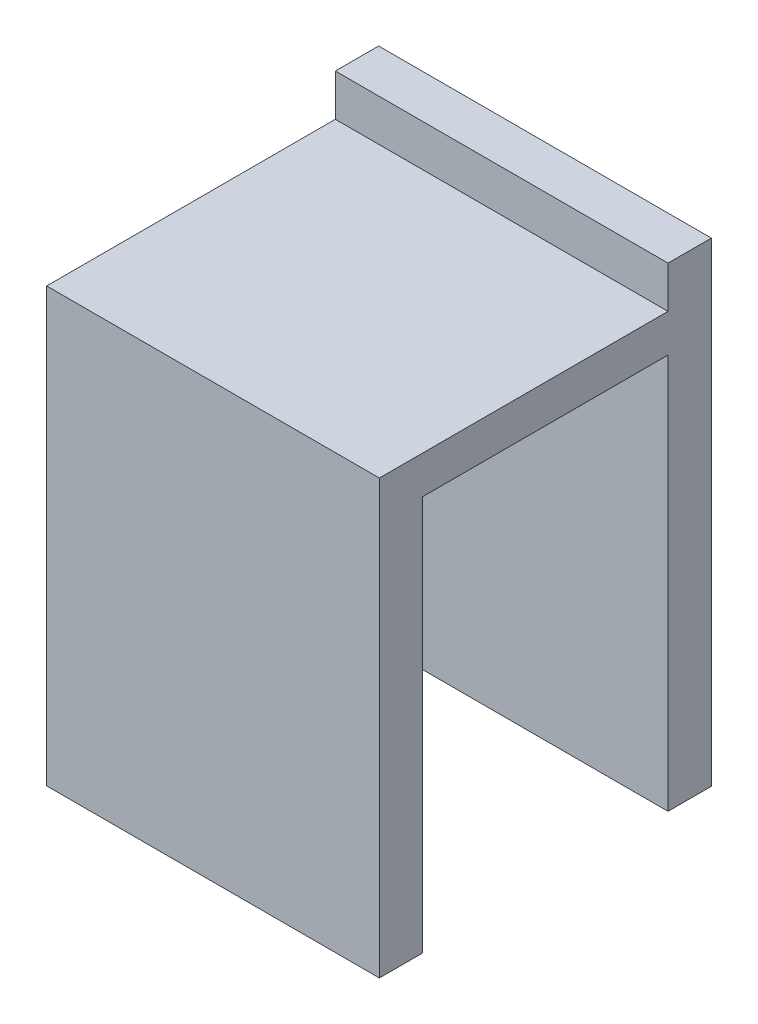
ISO-10303-21;
HEADER;
FILE_DESCRIPTION(('STEP AP214'),'2;1');
FILE_NAME('part.step','',(''),(''),'','','');
FILE_SCHEMA(('AUTOMOTIVE_DESIGN { 1 0 10303 214 1 1 1 1 }'));
ENDSEC;
DATA;
#1=APPLICATION_CONTEXT('core data for automotive mechanical design processes');
#2=APPLICATION_PROTOCOL_DEFINITION('international standard','automotive_design',2000,#1);
#3=PRODUCT_CONTEXT('',#1,'mechanical');
#4=PRODUCT('Part','Part','',(#3));
#5=PRODUCT_RELATED_PRODUCT_CATEGORY('part','',(#4));
#6=PRODUCT_DEFINITION_FORMATION('','',#4);
#7=PRODUCT_DEFINITION_CONTEXT('part definition',#1,'design');
#8=PRODUCT_DEFINITION('design','',#6,#7);
#9=PRODUCT_DEFINITION_SHAPE('','',#8);
#10=(LENGTH_UNIT() NAMED_UNIT(*) SI_UNIT(.MILLI.,.METRE.));
#11=(NAMED_UNIT(*) PLANE_ANGLE_UNIT() SI_UNIT($,.RADIAN.));
#12=(NAMED_UNIT(*) SI_UNIT($,.STERADIAN.) SOLID_ANGLE_UNIT());
#13=UNCERTAINTY_MEASURE_WITH_UNIT(LENGTH_MEASURE(1.E-05),#10,'distance_accuracy_value','');
#14=(GEOMETRIC_REPRESENTATION_CONTEXT(3) GLOBAL_UNCERTAINTY_ASSIGNED_CONTEXT((#13)) GLOBAL_UNIT_ASSIGNED_CONTEXT((#10,
#11,#12)) REPRESENTATION_CONTEXT('',''));
#15=CARTESIAN_POINT('',(0.,0.,0.));
#16=DIRECTION('',(0.,0.,1.));
#17=DIRECTION('',(1.,0.,0.));
#18=AXIS2_PLACEMENT_3D('',#15,#16,#17);
#19=CARTESIAN_POINT('',(-91.2408376963351,19.5358541731836,-180.));
#20=DIRECTION('',(0.,1.,0.));
#21=DIRECTION('',(0.,0.,1.));
#22=AXIS2_PLACEMENT_3D('',#19,#20,#21);
#23=PLANE('',#22);
#24=DIRECTION('',(-1.,0.,0.));
#25=VECTOR('',#24,1.);
#26=CARTESIAN_POINT('',(-91.2408376963351,19.5358541731836,-183.));
#27=LINE('',#26,#25);
#28=CARTESIAN_POINT('',(-68.1887783386787,19.5358541731836,-183.));
#29=VERTEX_POINT('',#28);
#30=CARTESIAN_POINT('',(-91.2408376963351,19.5358541731836,-183.));
#31=VERTEX_POINT('',#30);
#32=EDGE_CURVE('E119',#29,#31,#27,.T.);
#33=ORIENTED_EDGE('',*,*,#32,.T.);
#34=DIRECTION('',(0.,0.,-1.));
#35=VECTOR('',#34,1.);
#36=CARTESIAN_POINT('',(-91.2408376963351,19.5358541731836,-180.));
#37=LINE('',#36,#35);
#38=CARTESIAN_POINT('',(-91.2408376963351,19.5358541731836,-200.));
#39=VERTEX_POINT('',#38);
#40=EDGE_CURVE('E132',#31,#39,#37,.T.);
#41=ORIENTED_EDGE('',*,*,#40,.T.);
#42=DIRECTION('',(1.,0.,0.));
#43=VECTOR('',#42,1.);
#44=CARTESIAN_POINT('',(-91.2408376963351,19.5358541731836,-200.));
#45=LINE('',#44,#43);
#46=CARTESIAN_POINT('',(-68.1887783386787,19.5358541731836,-200.));
#47=VERTEX_POINT('',#46);
#48=EDGE_CURVE('E138',#39,#47,#45,.T.);
#49=ORIENTED_EDGE('',*,*,#48,.T.);
#50=DIRECTION('',(0.,0.,-1.));
#51=VECTOR('',#50,1.);
#52=CARTESIAN_POINT('',(-68.1887783386787,19.5358541731836,-180.));
#53=LINE('',#52,#51);
#54=EDGE_CURVE('E155',#29,#47,#53,.T.);
#55=ORIENTED_EDGE('',*,*,#54,.F.);
#56=EDGE_LOOP('',(#33,#41,#49,#55));
#57=FACE_BOUND('',#56,.T.);
#58=ADVANCED_FACE('F32',(#57),#23,.F.);
#59=CARTESIAN_POINT('',(0.,0.,-200.));
#60=DIRECTION('',(0.,0.,1.));
#61=DIRECTION('',(1.,0.,0.));
#62=AXIS2_PLACEMENT_3D('',#59,#60,#61);
#63=PLANE('',#62);
#64=DIRECTION('',(-1.,0.,0.));
#65=VECTOR('',#64,1.);
#66=CARTESIAN_POINT('',(-91.2408376963351,22.1544502617801,-200.));
#67=LINE('',#66,#65);
#68=CARTESIAN_POINT('',(-68.1887783386787,22.1544502617801,-200.));
#69=VERTEX_POINT('',#68);
#70=CARTESIAN_POINT('',(-91.2408376963351,22.1544502617801,-200.));
#71=VERTEX_POINT('',#70);
#72=EDGE_CURVE('E47',#69,#71,#67,.T.);
#73=ORIENTED_EDGE('',*,*,#72,.F.);
#74=DIRECTION('',(0.,-1.,0.));
#75=VECTOR('',#74,1.);
#76=CARTESIAN_POINT('',(-68.1887783386787,22.1544502617801,-200.));
#77=LINE('',#76,#75);
#78=CARTESIAN_POINT('',(-68.1887783386787,25.0516302200133,-200.));
#79=VERTEX_POINT('',#78);
#80=EDGE_CURVE('E174',#79,#69,#77,.T.);
#81=ORIENTED_EDGE('',*,*,#80,.F.);
#82=DIRECTION('',(1.,0.,0.));
#83=VECTOR('',#82,1.);
#84=CARTESIAN_POINT('',(-68.1887783386787,25.0516302200133,-200.));
#85=LINE('',#84,#83);
#86=CARTESIAN_POINT('',(-91.2408376963351,25.0516302200133,-200.));
#87=VERTEX_POINT('',#86);
#88=EDGE_CURVE('E158',#87,#79,#85,.T.);
#89=ORIENTED_EDGE('',*,*,#88,.F.);
#90=DIRECTION('',(0.,1.,0.));
#91=VECTOR('',#90,1.);
#92=CARTESIAN_POINT('',(-91.2408376963351,22.1544502617801,-200.));
#93=LINE('',#92,#91);
#94=EDGE_CURVE('E52',#71,#87,#93,.T.);
#95=ORIENTED_EDGE('',*,*,#94,.F.);
#96=EDGE_LOOP('',(#73,#81,#89,#95));
#97=FACE_BOUND('',#96,.T.);
#98=ADVANCED_FACE('F192',(#97),#63,.T.);
#99=CARTESIAN_POINT('',(-68.1887783386787,25.0516302200133,-203.));
#100=DIRECTION('',(0.,-1.,0.));
#101=DIRECTION('',(0.,0.,-1.));
#102=AXIS2_PLACEMENT_3D('',#99,#100,#101);
#103=PLANE('',#102);
#104=ORIENTED_EDGE('',*,*,#88,.T.);
#105=DIRECTION('',(0.,0.,1.));
#106=VECTOR('',#105,1.);
#107=CARTESIAN_POINT('',(-68.1887783386787,25.0516302200133,-203.));
#108=LINE('',#107,#106);
#109=CARTESIAN_POINT('',(-68.1887783386787,25.0516302200133,-203.));
#110=VERTEX_POINT('',#109);
#111=EDGE_CURVE('E40',#110,#79,#108,.T.);
#112=ORIENTED_EDGE('',*,*,#111,.F.);
#113=DIRECTION('',(1.,0.,0.));
#114=VECTOR('',#113,1.);
#115=CARTESIAN_POINT('',(-68.1887783386787,25.0516302200133,-203.));
#116=LINE('',#115,#114);
#117=CARTESIAN_POINT('',(-91.2408376963351,25.0516302200133,-203.));
#118=VERTEX_POINT('',#117);
#119=EDGE_CURVE('E162',#118,#110,#116,.T.);
#120=ORIENTED_EDGE('',*,*,#119,.F.);
#121=DIRECTION('',(0.,0.,1.));
#122=VECTOR('',#121,1.);
#123=CARTESIAN_POINT('',(-91.2408376963351,25.0516302200133,-203.));
#124=LINE('',#123,#122);
#125=EDGE_CURVE('E11',#118,#87,#124,.T.);
#126=ORIENTED_EDGE('',*,*,#125,.T.);
#127=EDGE_LOOP('',(#104,#112,#120,#126));
#128=FACE_BOUND('',#127,.T.);
#129=ADVANCED_FACE('F34',(#128),#103,.F.);
#130=CARTESIAN_POINT('',(-68.1887783386787,22.1544502617801,-203.));
#131=DIRECTION('',(-1.,0.,0.));
#132=DIRECTION('',(0.,0.,1.));
#133=AXIS2_PLACEMENT_3D('',#130,#131,#132);
#134=PLANE('',#133);
#135=ORIENTED_EDGE('',*,*,#80,.T.);
#136=DIRECTION('',(0.,0.,-1.));
#137=VECTOR('',#136,1.);
#138=CARTESIAN_POINT('',(-68.1887783386787,22.1544502617801,-180.));
#139=LINE('',#138,#137);
#140=CARTESIAN_POINT('',(-68.1887783386787,22.1544502617801,-180.));
#141=VERTEX_POINT('',#140);
#142=EDGE_CURVE('E152',#141,#69,#139,.T.);
#143=ORIENTED_EDGE('',*,*,#142,.F.);
#144=DIRECTION('',(0.,1.,0.));
#145=VECTOR('',#144,1.);
#146=CARTESIAN_POINT('',(-68.1887783386787,19.5358541731836,-180.));
#147=LINE('',#146,#145);
#148=CARTESIAN_POINT('',(-68.1887783386787,-7.84554973821993,-180.));
#149=VERTEX_POINT('',#148);
#150=EDGE_CURVE('E142',#149,#141,#147,.T.);
#151=ORIENTED_EDGE('',*,*,#150,.F.);
#152=DIRECTION('',(0.,0.,1.));
#153=VECTOR('',#152,1.);
#154=CARTESIAN_POINT('',(-68.1887783386787,-7.84554973821993,-183.));
#155=LINE('',#154,#153);
#156=CARTESIAN_POINT('',(-68.1887783386787,-7.84554973821993,-183.));
#157=VERTEX_POINT('',#156);
#158=EDGE_CURVE('E118',#157,#149,#155,.T.);
#159=ORIENTED_EDGE('',*,*,#158,.F.);
#160=DIRECTION('',(0.,1.,0.));
#161=VECTOR('',#160,1.);
#162=CARTESIAN_POINT('',(-68.1887783386787,19.5358541731836,-183.));
#163=LINE('',#162,#161);
#164=EDGE_CURVE('E127',#157,#29,#163,.T.);
#165=ORIENTED_EDGE('',*,*,#164,.T.);
#166=ORIENTED_EDGE('',*,*,#54,.T.);
#167=CARTESIAN_POINT('',(-68.1887783386787,-7.84554973821993,-200.));
#168=VERTEX_POINT('',#167);
#169=EDGE_CURVE('E173',#47,#168,#77,.T.);
#170=ORIENTED_EDGE('',*,*,#169,.T.);
#171=DIRECTION('',(0.,0.,1.));
#172=VECTOR('',#171,1.);
#173=CARTESIAN_POINT('',(-68.1887783386787,-7.84554973821993,-203.));
#174=LINE('',#173,#172);
#175=CARTESIAN_POINT('',(-68.1887783386787,-7.84554973821993,-203.));
#176=VERTEX_POINT('',#175);
#177=EDGE_CURVE('E181',#176,#168,#174,.T.);
#178=ORIENTED_EDGE('',*,*,#177,.F.);
#179=DIRECTION('',(0.,-1.,0.));
#180=VECTOR('',#179,1.);
#181=CARTESIAN_POINT('',(-68.1887783386787,22.1544502617801,-203.));
#182=LINE('',#181,#180);
#183=EDGE_CURVE('E165',#110,#176,#182,.T.);
#184=ORIENTED_EDGE('',*,*,#183,.F.);
#185=ORIENTED_EDGE('',*,*,#111,.T.);
#186=EDGE_LOOP('',(#135,#143,#151,#159,#165,#166,#170,#178,#184,#185));
#187=FACE_BOUND('',#186,.T.);
#188=ADVANCED_FACE('F187',(#187),#134,.F.);
#189=CARTESIAN_POINT('',(-91.2408376963351,-7.84554973821992,-203.));
#190=DIRECTION('',(0.,1.,0.));
#191=DIRECTION('',(-1.,0.,0.));
#192=AXIS2_PLACEMENT_3D('',#189,#190,#191);
#193=PLANE('',#192);
#194=DIRECTION('',(-1.,0.,0.));
#195=VECTOR('',#194,1.);
#196=CARTESIAN_POINT('',(-91.2408376963351,-7.84554973821992,-200.));
#197=LINE('',#196,#195);
#198=CARTESIAN_POINT('',(-91.2408376963351,-7.84554973821992,-200.));
#199=VERTEX_POINT('',#198);
#200=EDGE_CURVE('E176',#168,#199,#197,.T.);
#201=ORIENTED_EDGE('',*,*,#200,.T.);
#202=DIRECTION('',(0.,0.,1.));
#203=VECTOR('',#202,1.);
#204=CARTESIAN_POINT('',(-91.2408376963351,-7.84554973821992,-203.));
#205=LINE('',#204,#203);
#206=CARTESIAN_POINT('',(-91.2408376963351,-7.84554973821992,-203.));
#207=VERTEX_POINT('',#206);
#208=EDGE_CURVE('E170',#207,#199,#205,.T.);
#209=ORIENTED_EDGE('',*,*,#208,.F.);
#210=DIRECTION('',(-1.,0.,0.));
#211=VECTOR('',#210,1.);
#212=CARTESIAN_POINT('',(-91.2408376963351,-7.84554973821992,-203.));
#213=LINE('',#212,#211);
#214=EDGE_CURVE('E167',#176,#207,#213,.T.);
#215=ORIENTED_EDGE('',*,*,#214,.F.);
#216=ORIENTED_EDGE('',*,*,#177,.T.);
#217=EDGE_LOOP('',(#201,#209,#215,#216));
#218=FACE_BOUND('',#217,.T.);
#219=ADVANCED_FACE('F224',(#218),#193,.F.);
#220=CARTESIAN_POINT('',(-91.2408376963351,22.1544502617801,-203.));
#221=DIRECTION('',(1.,0.,0.));
#222=DIRECTION('',(0.,0.,-1.));
#223=AXIS2_PLACEMENT_3D('',#220,#221,#222);
#224=PLANE('',#223);
#225=EDGE_CURVE('E163',#199,#39,#93,.T.);
#226=ORIENTED_EDGE('',*,*,#225,.T.);
#227=ORIENTED_EDGE('',*,*,#40,.F.);
#228=DIRECTION('',(0.,-1.,0.));
#229=VECTOR('',#228,1.);
#230=CARTESIAN_POINT('',(-91.2408376963351,19.5358541731836,-183.));
#231=LINE('',#230,#229);
#232=CARTESIAN_POINT('',(-91.2408376963351,-7.84554973821993,-183.));
#233=VERTEX_POINT('',#232);
#234=EDGE_CURVE('E125',#31,#233,#231,.T.);
#235=ORIENTED_EDGE('',*,*,#234,.T.);
#236=DIRECTION('',(0.,0.,1.));
#237=VECTOR('',#236,1.);
#238=CARTESIAN_POINT('',(-91.2408376963351,-7.84554973821993,-183.));
#239=LINE('',#238,#237);
#240=CARTESIAN_POINT('',(-91.2408376963351,-7.84554973821993,-180.));
#241=VERTEX_POINT('',#240);
#242=EDGE_CURVE('E108',#233,#241,#239,.T.);
#243=ORIENTED_EDGE('',*,*,#242,.T.);
#244=DIRECTION('',(0.,-1.,0.));
#245=VECTOR('',#244,1.);
#246=CARTESIAN_POINT('',(-91.2408376963351,19.5358541731836,-180.));
#247=LINE('',#246,#245);
#248=CARTESIAN_POINT('',(-91.2408376963351,22.1544502617801,-180.));
#249=VERTEX_POINT('',#248);
#250=EDGE_CURVE('E140',#249,#241,#247,.T.);
#251=ORIENTED_EDGE('',*,*,#250,.F.);
#252=DIRECTION('',(0.,0.,-1.));
#253=VECTOR('',#252,1.);
#254=CARTESIAN_POINT('',(-91.2408376963351,22.1544502617801,-180.));
#255=LINE('',#254,#253);
#256=EDGE_CURVE('E146',#249,#71,#255,.T.);
#257=ORIENTED_EDGE('',*,*,#256,.T.);
#258=ORIENTED_EDGE('',*,*,#94,.T.);
#259=ORIENTED_EDGE('',*,*,#125,.F.);
#260=DIRECTION('',(0.,1.,0.));
#261=VECTOR('',#260,1.);
#262=CARTESIAN_POINT('',(-91.2408376963351,22.1544502617801,-203.));
#263=LINE('',#262,#261);
#264=EDGE_CURVE('E159',#207,#118,#263,.T.);
#265=ORIENTED_EDGE('',*,*,#264,.F.);
#266=ORIENTED_EDGE('',*,*,#208,.T.);
#267=EDGE_LOOP('',(#226,#227,#235,#243,#251,#257,#258,#259,#265,#266));
#268=FACE_BOUND('',#267,.T.);
#269=ADVANCED_FACE('F131',(#268),#224,.F.);
#270=CARTESIAN_POINT('',(0.,0.,-203.));
#271=DIRECTION('',(0.,0.,1.));
#272=DIRECTION('',(1.,0.,0.));
#273=AXIS2_PLACEMENT_3D('',#270,#271,#272);
#274=PLANE('',#273);
#275=ORIENTED_EDGE('',*,*,#264,.T.);
#276=ORIENTED_EDGE('',*,*,#119,.T.);
#277=ORIENTED_EDGE('',*,*,#183,.T.);
#278=ORIENTED_EDGE('',*,*,#214,.T.);
#279=EDGE_LOOP('',(#275,#276,#277,#278));
#280=FACE_BOUND('',#279,.T.);
#281=ADVANCED_FACE('F206',(#280),#274,.F.);
#282=ORIENTED_EDGE('',*,*,#48,.F.);
#283=ORIENTED_EDGE('',*,*,#225,.F.);
#284=ORIENTED_EDGE('',*,*,#200,.F.);
#285=ORIENTED_EDGE('',*,*,#169,.F.);
#286=EDGE_LOOP('',(#282,#283,#284,#285));
#287=FACE_BOUND('',#286,.T.);
#288=ADVANCED_FACE('F195',(#287),#63,.T.);
#289=CARTESIAN_POINT('',(-91.2408376963351,22.1544502617801,-180.));
#290=DIRECTION('',(0.,-1.,0.));
#291=DIRECTION('',(0.,0.,-1.));
#292=AXIS2_PLACEMENT_3D('',#289,#290,#291);
#293=PLANE('',#292);
#294=ORIENTED_EDGE('',*,*,#72,.T.);
#295=ORIENTED_EDGE('',*,*,#256,.F.);
#296=DIRECTION('',(-1.,0.,0.));
#297=VECTOR('',#296,1.);
#298=CARTESIAN_POINT('',(-91.2408376963351,22.1544502617801,-180.));
#299=LINE('',#298,#297);
#300=EDGE_CURVE('E144',#141,#249,#299,.T.);
#301=ORIENTED_EDGE('',*,*,#300,.F.);
#302=ORIENTED_EDGE('',*,*,#142,.T.);
#303=EDGE_LOOP('',(#294,#295,#301,#302));
#304=FACE_BOUND('',#303,.T.);
#305=ADVANCED_FACE('F205',(#304),#293,.F.);
#306=CARTESIAN_POINT('',(0.,0.,-180.));
#307=DIRECTION('',(0.,0.,-1.));
#308=DIRECTION('',(-1.,0.,0.));
#309=AXIS2_PLACEMENT_3D('',#306,#307,#308);
#310=PLANE('',#309);
#311=ORIENTED_EDGE('',*,*,#250,.T.);
#312=DIRECTION('',(1.,0.,0.));
#313=VECTOR('',#312,1.);
#314=CARTESIAN_POINT('',(-91.2408376963351,-7.84554973821993,-180.));
#315=LINE('',#314,#313);
#316=EDGE_CURVE('E114',#241,#149,#315,.T.);
#317=ORIENTED_EDGE('',*,*,#316,.T.);
#318=ORIENTED_EDGE('',*,*,#150,.T.);
#319=ORIENTED_EDGE('',*,*,#300,.T.);
#320=EDGE_LOOP('',(#311,#317,#318,#319));
#321=FACE_BOUND('',#320,.T.);
#322=ADVANCED_FACE('F212',(#321),#310,.F.);
#323=CARTESIAN_POINT('',(-91.2408376963351,-7.84554973821993,-183.));
#324=DIRECTION('',(0.,-1.,0.));
#325=DIRECTION('',(0.,0.,-1.));
#326=AXIS2_PLACEMENT_3D('',#323,#324,#325);
#327=PLANE('',#326);
#328=ORIENTED_EDGE('',*,*,#316,.F.);
#329=ORIENTED_EDGE('',*,*,#242,.F.);
#330=DIRECTION('',(1.,0.,0.));
#331=VECTOR('',#330,1.);
#332=CARTESIAN_POINT('',(-91.2408376963351,-7.84554973821993,-183.));
#333=LINE('',#332,#331);
#334=EDGE_CURVE('E112',#233,#157,#333,.T.);
#335=ORIENTED_EDGE('',*,*,#334,.T.);
#336=ORIENTED_EDGE('',*,*,#158,.T.);
#337=EDGE_LOOP('',(#328,#329,#335,#336));
#338=FACE_BOUND('',#337,.T.);
#339=ADVANCED_FACE('F110',(#338),#327,.T.);
#340=CARTESIAN_POINT('',(0.,0.,-183.));
#341=DIRECTION('',(0.,0.,1.));
#342=DIRECTION('',(1.,0.,0.));
#343=AXIS2_PLACEMENT_3D('',#340,#341,#342);
#344=PLANE('',#343);
#345=ORIENTED_EDGE('',*,*,#234,.F.);
#346=ORIENTED_EDGE('',*,*,#32,.F.);
#347=ORIENTED_EDGE('',*,*,#164,.F.);
#348=ORIENTED_EDGE('',*,*,#334,.F.);
#349=EDGE_LOOP('',(#345,#346,#347,#348));
#350=FACE_BOUND('',#349,.T.);
#351=ADVANCED_FACE('F123',(#350),#344,.F.);
#352=CLOSED_SHELL('',(#58,#98,#129,#188,#219,#269,#281,#288,#305,#322,#339,#351));
#353=MANIFOLD_SOLID_BREP('B2',#352);
#354=ADVANCED_BREP_SHAPE_REPRESENTATION('',(#18,#353),#14);
#355=SHAPE_DEFINITION_REPRESENTATION(#9,#354);
ENDSEC;
END-ISO-10303-21;
